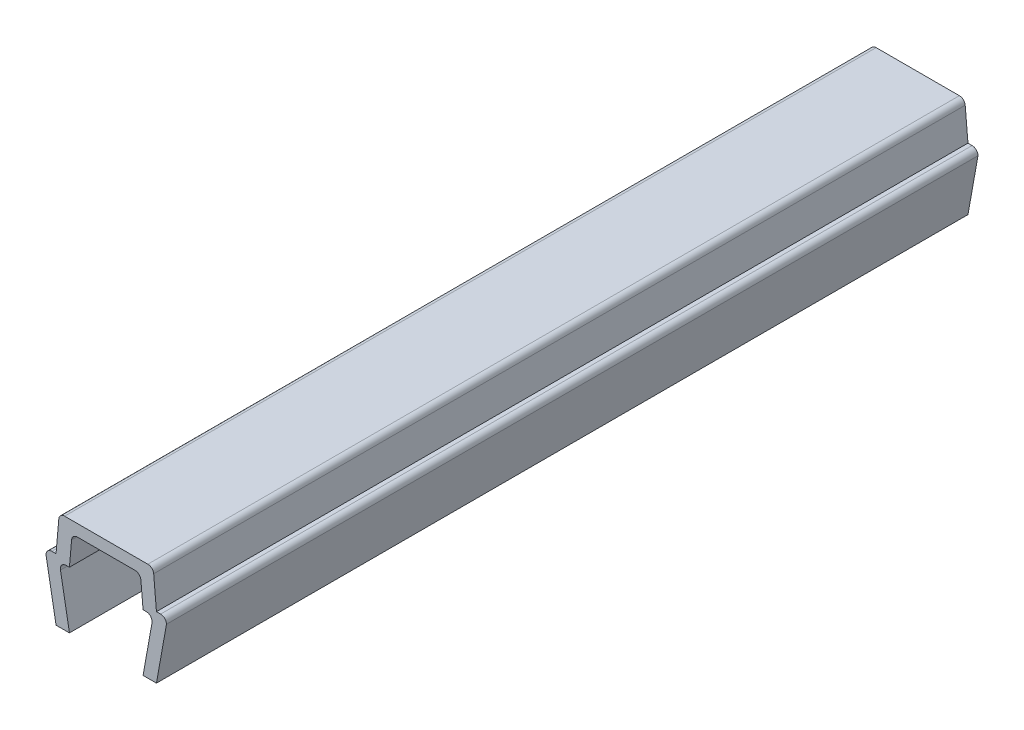
ISO-10303-21;
HEADER;
FILE_DESCRIPTION(('STEP AP214'),'2;1');
FILE_NAME('part.step','',(''),(''),'','','');
FILE_SCHEMA(('AUTOMOTIVE_DESIGN { 1 0 10303 214 1 1 1 1 }'));
ENDSEC;
DATA;
#1=APPLICATION_CONTEXT('core data for automotive mechanical design processes');
#2=APPLICATION_PROTOCOL_DEFINITION('international standard','automotive_design',2000,#1);
#3=PRODUCT_CONTEXT('',#1,'mechanical');
#4=PRODUCT('Part','Part','',(#3));
#5=PRODUCT_RELATED_PRODUCT_CATEGORY('part','',(#4));
#6=PRODUCT_DEFINITION_FORMATION('','',#4);
#7=PRODUCT_DEFINITION_CONTEXT('part definition',#1,'design');
#8=PRODUCT_DEFINITION('design','',#6,#7);
#9=PRODUCT_DEFINITION_SHAPE('','',#8);
#10=(LENGTH_UNIT() NAMED_UNIT(*) SI_UNIT(.MILLI.,.METRE.));
#11=(NAMED_UNIT(*) PLANE_ANGLE_UNIT() SI_UNIT($,.RADIAN.));
#12=(NAMED_UNIT(*) SI_UNIT($,.STERADIAN.) SOLID_ANGLE_UNIT());
#13=UNCERTAINTY_MEASURE_WITH_UNIT(LENGTH_MEASURE(1.E-05),#10,'distance_accuracy_value','');
#14=(GEOMETRIC_REPRESENTATION_CONTEXT(3) GLOBAL_UNCERTAINTY_ASSIGNED_CONTEXT((#13)) GLOBAL_UNIT_ASSIGNED_CONTEXT((#10,
#11,#12)) REPRESENTATION_CONTEXT('',''));
#15=CARTESIAN_POINT('',(0.,0.,0.));
#16=DIRECTION('',(0.,0.,1.));
#17=DIRECTION('',(1.,0.,0.));
#18=AXIS2_PLACEMENT_3D('',#15,#16,#17);
#19=CARTESIAN_POINT('',(-3.25000000000003,3.35000000000003,24.25));
#20=DIRECTION('',(0.,0.,-1.));
#21=DIRECTION('',(-1.,0.,0.));
#22=AXIS2_PLACEMENT_3D('',#19,#20,#21);
#23=CYLINDRICAL_SURFACE('',#22,0.349999999999972);
#24=DIRECTION('',(0.,0.,-1.));
#25=VECTOR('',#24,1.);
#26=CARTESIAN_POINT('',(-3.25,3.7,24.25));
#27=LINE('',#26,#25);
#28=CARTESIAN_POINT('',(-3.25,3.7,24.25));
#29=VERTEX_POINT('',#28);
#30=CARTESIAN_POINT('',(-3.25,3.7,-24.25));
#31=VERTEX_POINT('',#30);
#32=EDGE_CURVE('E211',#29,#31,#27,.T.);
#33=ORIENTED_EDGE('',*,*,#32,.T.);
#34=CARTESIAN_POINT('',(-3.25000000000003,3.35000000000003,-24.25));
#35=DIRECTION('',(0.,0.,1.));
#36=DIRECTION('',(1.,0.,0.));
#37=AXIS2_PLACEMENT_3D('',#34,#35,#36);
#38=CIRCLE('',#37,0.349999999999972);
#39=CARTESIAN_POINT('',(-3.6,3.35,-24.25));
#40=VERTEX_POINT('',#39);
#41=EDGE_CURVE('E205',#31,#40,#38,.T.);
#42=ORIENTED_EDGE('',*,*,#41,.T.);
#43=DIRECTION('',(0.,0.,-1.));
#44=VECTOR('',#43,1.);
#45=CARTESIAN_POINT('',(-3.6,3.35,24.25));
#46=LINE('',#45,#44);
#47=CARTESIAN_POINT('',(-3.6,3.35,24.25));
#48=VERTEX_POINT('',#47);
#49=EDGE_CURVE('E11',#48,#40,#46,.T.);
#50=ORIENTED_EDGE('',*,*,#49,.F.);
#51=CARTESIAN_POINT('',(-3.25000000000003,3.35000000000003,24.25));
#52=DIRECTION('',(0.,0.,1.));
#53=DIRECTION('',(1.,0.,0.));
#54=AXIS2_PLACEMENT_3D('',#51,#52,#53);
#55=CIRCLE('',#54,0.349999999999972);
#56=EDGE_CURVE('E277',#29,#48,#55,.T.);
#57=ORIENTED_EDGE('',*,*,#56,.F.);
#58=EDGE_LOOP('',(#33,#42,#50,#57));
#59=FACE_BOUND('',#58,.T.);
#60=ADVANCED_FACE('F33',(#59),#23,.T.);
#61=CARTESIAN_POINT('',(-3.6,3.35,24.25));
#62=DIRECTION('',(0.984336643247304,0.176299100283099,0.));
#63=DIRECTION('',(-0.176299100283099,0.984336643247304,0.));
#64=AXIS2_PLACEMENT_3D('',#61,#62,#63);
#65=PLANE('',#64);
#66=ORIENTED_EDGE('',*,*,#49,.T.);
#67=DIRECTION('',(0.176299100283099,-0.984336643247304,0.));
#68=VECTOR('',#67,1.);
#69=CARTESIAN_POINT('',(-3.6,3.35,-24.25));
#70=LINE('',#69,#68);
#71=CARTESIAN_POINT('',(-3.,0.,-24.25));
#72=VERTEX_POINT('',#71);
#73=EDGE_CURVE('E195',#40,#72,#70,.T.);
#74=ORIENTED_EDGE('',*,*,#73,.T.);
#75=DIRECTION('',(0.,0.,-1.));
#76=VECTOR('',#75,1.);
#77=CARTESIAN_POINT('',(-3.,0.,24.25));
#78=LINE('',#77,#76);
#79=CARTESIAN_POINT('',(-3.,0.,24.25));
#80=VERTEX_POINT('',#79);
#81=EDGE_CURVE('E40',#80,#72,#78,.T.);
#82=ORIENTED_EDGE('',*,*,#81,.F.);
#83=DIRECTION('',(0.176299100283099,-0.984336643247304,0.));
#84=VECTOR('',#83,1.);
#85=CARTESIAN_POINT('',(-3.6,3.35,24.25));
#86=LINE('',#85,#84);
#87=EDGE_CURVE('E196',#48,#80,#86,.T.);
#88=ORIENTED_EDGE('',*,*,#87,.F.);
#89=EDGE_LOOP('',(#66,#74,#82,#88));
#90=FACE_BOUND('',#89,.T.);
#91=ADVANCED_FACE('F193',(#90),#65,.F.);
#92=CARTESIAN_POINT('',(-3.,0.,24.25));
#93=DIRECTION('',(0.,1.,0.));
#94=DIRECTION('',(0.,0.,1.));
#95=AXIS2_PLACEMENT_3D('',#92,#93,#94);
#96=PLANE('',#95);
#97=ORIENTED_EDGE('',*,*,#81,.T.);
#98=DIRECTION('',(1.,0.,0.));
#99=VECTOR('',#98,1.);
#100=CARTESIAN_POINT('',(-3.,0.,-24.25));
#101=LINE('',#100,#99);
#102=CARTESIAN_POINT('',(-2.2,0.,-24.25));
#103=VERTEX_POINT('',#102);
#104=EDGE_CURVE('E209',#72,#103,#101,.T.);
#105=ORIENTED_EDGE('',*,*,#104,.T.);
#106=DIRECTION('',(0.,0.,-1.));
#107=VECTOR('',#106,1.);
#108=CARTESIAN_POINT('',(-2.2,0.,24.25));
#109=LINE('',#108,#107);
#110=CARTESIAN_POINT('',(-2.2,0.,24.25));
#111=VERTEX_POINT('',#110);
#112=EDGE_CURVE('E363',#111,#103,#109,.T.);
#113=ORIENTED_EDGE('',*,*,#112,.F.);
#114=DIRECTION('',(1.,0.,0.));
#115=VECTOR('',#114,1.);
#116=CARTESIAN_POINT('',(-3.,0.,24.25));
#117=LINE('',#116,#115);
#118=EDGE_CURVE('E280',#80,#111,#117,.T.);
#119=ORIENTED_EDGE('',*,*,#118,.F.);
#120=EDGE_LOOP('',(#97,#105,#113,#119));
#121=FACE_BOUND('',#120,.T.);
#122=ADVANCED_FACE('F366',(#121),#96,.F.);
#123=CARTESIAN_POINT('',(-2.2,0.,24.25));
#124=DIRECTION('',(-0.984336643247306,-0.176299100283088,0.));
#125=DIRECTION('',(0.176299100283088,-0.984336643247306,0.));
#126=AXIS2_PLACEMENT_3D('',#123,#124,#125);
#127=PLANE('',#126);
#128=ORIENTED_EDGE('',*,*,#112,.T.);
#129=DIRECTION('',(-0.176299100283088,0.984336643247306,0.));
#130=VECTOR('',#129,1.);
#131=CARTESIAN_POINT('',(-2.2,0.,-24.25));
#132=LINE('',#131,#130);
#133=CARTESIAN_POINT('',(-2.7352170713255,2.9882953149009,-24.25));
#134=VERTEX_POINT('',#133);
#135=EDGE_CURVE('E215',#103,#134,#132,.T.);
#136=ORIENTED_EDGE('',*,*,#135,.T.);
#137=DIRECTION('',(0.,0.,-1.));
#138=VECTOR('',#137,1.);
#139=CARTESIAN_POINT('',(-2.7352170713255,2.9882953149009,24.25));
#140=LINE('',#139,#138);
#141=CARTESIAN_POINT('',(-2.7352170713255,2.9882953149009,24.25));
#142=VERTEX_POINT('',#141);
#143=EDGE_CURVE('E361',#142,#134,#140,.T.);
#144=ORIENTED_EDGE('',*,*,#143,.F.);
#145=DIRECTION('',(-0.176299100283088,0.984336643247306,0.));
#146=VECTOR('',#145,1.);
#147=CARTESIAN_POINT('',(-2.2,0.,24.25));
#148=LINE('',#147,#146);
#149=EDGE_CURVE('E282',#111,#142,#148,.T.);
#150=ORIENTED_EDGE('',*,*,#149,.F.);
#151=EDGE_LOOP('',(#128,#136,#144,#150));
#152=FACE_BOUND('',#151,.T.);
#153=ADVANCED_FACE('F374',(#152),#127,.F.);
#154=CARTESIAN_POINT('',(-2.390699246189,3.05000000000004,24.25));
#155=DIRECTION('',(0.,0.,-1.));
#156=DIRECTION('',(-1.,0.,0.));
#157=AXIS2_PLACEMENT_3D('',#154,#155,#156);
#158=CYLINDRICAL_SURFACE('',#157,0.349999999999955);
#159=ORIENTED_EDGE('',*,*,#143,.T.);
#160=CARTESIAN_POINT('',(-2.390699246189,3.05000000000004,-24.25));
#161=DIRECTION('',(0.,0.,-1.));
#162=DIRECTION('',(-1.,0.,0.));
#163=AXIS2_PLACEMENT_3D('',#160,#161,#162);
#164=CIRCLE('',#163,0.349999999999955);
#165=CARTESIAN_POINT('',(-2.390699246189,3.4,-24.25));
#166=VERTEX_POINT('',#165);
#167=EDGE_CURVE('E218',#134,#166,#164,.T.);
#168=ORIENTED_EDGE('',*,*,#167,.T.);
#169=DIRECTION('',(0.,0.,-1.));
#170=VECTOR('',#169,1.);
#171=CARTESIAN_POINT('',(-2.390699246189,3.4,24.25));
#172=LINE('',#171,#170);
#173=CARTESIAN_POINT('',(-2.390699246189,3.4,24.25));
#174=VERTEX_POINT('',#173);
#175=EDGE_CURVE('E359',#174,#166,#172,.T.);
#176=ORIENTED_EDGE('',*,*,#175,.F.);
#177=CARTESIAN_POINT('',(-2.390699246189,3.05000000000004,24.25));
#178=DIRECTION('',(0.,0.,-1.));
#179=DIRECTION('',(-1.,0.,0.));
#180=AXIS2_PLACEMENT_3D('',#177,#178,#179);
#181=CIRCLE('',#180,0.349999999999955);
#182=EDGE_CURVE('E284',#142,#174,#181,.T.);
#183=ORIENTED_EDGE('',*,*,#182,.F.);
#184=EDGE_LOOP('',(#159,#168,#176,#183));
#185=FACE_BOUND('',#184,.T.);
#186=ADVANCED_FACE('F377',(#185),#158,.F.);
#187=CARTESIAN_POINT('',(-2.390699246189,3.4,24.25));
#188=DIRECTION('',(0.,1.,0.));
#189=DIRECTION('',(0.,0.,1.));
#190=AXIS2_PLACEMENT_3D('',#187,#188,#189);
#191=PLANE('',#190);
#192=ORIENTED_EDGE('',*,*,#175,.T.);
#193=DIRECTION('',(1.,0.,0.));
#194=VECTOR('',#193,1.);
#195=CARTESIAN_POINT('',(-2.390699246189,3.4,-24.25));
#196=LINE('',#195,#194);
#197=CARTESIAN_POINT('',(-2.2,3.4,-24.25));
#198=VERTEX_POINT('',#197);
#199=EDGE_CURVE('E221',#166,#198,#196,.T.);
#200=ORIENTED_EDGE('',*,*,#199,.T.);
#201=DIRECTION('',(0.,0.,-1.));
#202=VECTOR('',#201,1.);
#203=CARTESIAN_POINT('',(-2.2,3.4,24.25));
#204=LINE('',#203,#202);
#205=CARTESIAN_POINT('',(-2.2,3.4,24.25));
#206=VERTEX_POINT('',#205);
#207=EDGE_CURVE('E357',#206,#198,#204,.T.);
#208=ORIENTED_EDGE('',*,*,#207,.F.);
#209=DIRECTION('',(1.,0.,0.));
#210=VECTOR('',#209,1.);
#211=CARTESIAN_POINT('',(-2.390699246189,3.4,24.25));
#212=LINE('',#211,#210);
#213=EDGE_CURVE('E286',#174,#206,#212,.T.);
#214=ORIENTED_EDGE('',*,*,#213,.F.);
#215=EDGE_LOOP('',(#192,#200,#208,#214));
#216=FACE_BOUND('',#215,.T.);
#217=ADVANCED_FACE('F382',(#216),#191,.F.);
#218=CARTESIAN_POINT('',(-2.2,3.4,24.25));
#219=DIRECTION('',(-0.996194698091743,0.08715574274769,0.));
#220=DIRECTION('',(-0.08715574274769,-0.996194698091743,0.));
#221=AXIS2_PLACEMENT_3D('',#218,#219,#220);
#222=PLANE('',#221);
#223=ORIENTED_EDGE('',*,*,#207,.T.);
#224=DIRECTION('',(0.08715574274769,0.996194698091743,0.));
#225=VECTOR('',#224,1.);
#226=CARTESIAN_POINT('',(-2.2,3.4,-24.25));
#227=LINE('',#226,#225);
#228=CARTESIAN_POINT('',(-2.0704726390793,4.8805045099617,-24.25));
#229=VERTEX_POINT('',#228);
#230=EDGE_CURVE('E224',#198,#229,#227,.T.);
#231=ORIENTED_EDGE('',*,*,#230,.T.);
#232=DIRECTION('',(0.,0.,-1.));
#233=VECTOR('',#232,1.);
#234=CARTESIAN_POINT('',(-2.0704726390793,4.8805045099617,24.25));
#235=LINE('',#234,#233);
#236=CARTESIAN_POINT('',(-2.0704726390793,4.8805045099617,24.25));
#237=VERTEX_POINT('',#236);
#238=EDGE_CURVE('E355',#237,#229,#235,.T.);
#239=ORIENTED_EDGE('',*,*,#238,.F.);
#240=DIRECTION('',(0.08715574274769,0.996194698091743,0.));
#241=VECTOR('',#240,1.);
#242=CARTESIAN_POINT('',(-2.2,3.4,24.25));
#243=LINE('',#242,#241);
#244=EDGE_CURVE('E288',#206,#237,#243,.T.);
#245=ORIENTED_EDGE('',*,*,#244,.F.);
#246=EDGE_LOOP('',(#223,#231,#239,#245));
#247=FACE_BOUND('',#246,.T.);
#248=ADVANCED_FACE('F388',(#247),#222,.F.);
#249=CARTESIAN_POINT('',(-1.72180449474716,4.84999999999996,24.25));
#250=DIRECTION('',(0.,0.,-1.));
#251=DIRECTION('',(-1.,0.,0.));
#252=AXIS2_PLACEMENT_3D('',#249,#250,#251);
#253=CYLINDRICAL_SURFACE('',#252,0.350000000000036);
#254=ORIENTED_EDGE('',*,*,#238,.T.);
#255=CARTESIAN_POINT('',(-1.72180449474716,4.84999999999996,-24.25));
#256=DIRECTION('',(0.,0.,-1.));
#257=DIRECTION('',(-1.,0.,0.));
#258=AXIS2_PLACEMENT_3D('',#255,#256,#257);
#259=CIRCLE('',#258,0.350000000000036);
#260=CARTESIAN_POINT('',(-1.7218044947472,5.2,-24.25));
#261=VERTEX_POINT('',#260);
#262=EDGE_CURVE('E227',#229,#261,#259,.T.);
#263=ORIENTED_EDGE('',*,*,#262,.T.);
#264=DIRECTION('',(0.,0.,-1.));
#265=VECTOR('',#264,1.);
#266=CARTESIAN_POINT('',(-1.7218044947472,5.2,24.25));
#267=LINE('',#266,#265);
#268=CARTESIAN_POINT('',(-1.7218044947472,5.2,24.25));
#269=VERTEX_POINT('',#268);
#270=EDGE_CURVE('E353',#269,#261,#267,.T.);
#271=ORIENTED_EDGE('',*,*,#270,.F.);
#272=CARTESIAN_POINT('',(-1.72180449474716,4.84999999999996,24.25));
#273=DIRECTION('',(0.,0.,-1.));
#274=DIRECTION('',(-1.,0.,0.));
#275=AXIS2_PLACEMENT_3D('',#272,#273,#274);
#276=CIRCLE('',#275,0.350000000000036);
#277=EDGE_CURVE('E290',#237,#269,#276,.T.);
#278=ORIENTED_EDGE('',*,*,#277,.F.);
#279=EDGE_LOOP('',(#254,#263,#271,#278));
#280=FACE_BOUND('',#279,.T.);
#281=ADVANCED_FACE('F392',(#280),#253,.F.);
#282=CARTESIAN_POINT('',(-1.7218044947472,5.2,24.25));
#283=DIRECTION('',(0.,1.,0.));
#284=DIRECTION('',(0.,0.,1.));
#285=AXIS2_PLACEMENT_3D('',#282,#283,#284);
#286=PLANE('',#285);
#287=ORIENTED_EDGE('',*,*,#270,.T.);
#288=DIRECTION('',(1.,0.,0.));
#289=VECTOR('',#288,1.);
#290=CARTESIAN_POINT('',(-1.7218044947472,5.2,-24.25));
#291=LINE('',#290,#289);
#292=CARTESIAN_POINT('',(1.7218044947472,5.2,-24.25));
#293=VERTEX_POINT('',#292);
#294=EDGE_CURVE('E230',#261,#293,#291,.T.);
#295=ORIENTED_EDGE('',*,*,#294,.T.);
#296=DIRECTION('',(0.,0.,-1.));
#297=VECTOR('',#296,1.);
#298=CARTESIAN_POINT('',(1.7218044947472,5.2,24.25));
#299=LINE('',#298,#297);
#300=CARTESIAN_POINT('',(1.7218044947472,5.2,24.25));
#301=VERTEX_POINT('',#300);
#302=EDGE_CURVE('E351',#301,#293,#299,.T.);
#303=ORIENTED_EDGE('',*,*,#302,.F.);
#304=DIRECTION('',(1.,0.,0.));
#305=VECTOR('',#304,1.);
#306=CARTESIAN_POINT('',(-1.7218044947472,5.2,24.25));
#307=LINE('',#306,#305);
#308=EDGE_CURVE('E292',#269,#301,#307,.T.);
#309=ORIENTED_EDGE('',*,*,#308,.F.);
#310=EDGE_LOOP('',(#287,#295,#303,#309));
#311=FACE_BOUND('',#310,.T.);
#312=ADVANCED_FACE('F397',(#311),#286,.F.);
#313=CARTESIAN_POINT('',(1.72180449474716,4.84999999999996,24.25));
#314=DIRECTION('',(0.,0.,-1.));
#315=DIRECTION('',(-1.,0.,0.));
#316=AXIS2_PLACEMENT_3D('',#313,#314,#315);
#317=CYLINDRICAL_SURFACE('',#316,0.350000000000036);
#318=ORIENTED_EDGE('',*,*,#302,.T.);
#319=CARTESIAN_POINT('',(1.72180449474716,4.84999999999996,-24.25));
#320=DIRECTION('',(0.,0.,-1.));
#321=DIRECTION('',(-1.,0.,0.));
#322=AXIS2_PLACEMENT_3D('',#319,#320,#321);
#323=CIRCLE('',#322,0.350000000000036);
#324=CARTESIAN_POINT('',(2.0704726390793,4.8805045099617,-24.25));
#325=VERTEX_POINT('',#324);
#326=EDGE_CURVE('E233',#293,#325,#323,.T.);
#327=ORIENTED_EDGE('',*,*,#326,.T.);
#328=DIRECTION('',(0.,0.,-1.));
#329=VECTOR('',#328,1.);
#330=CARTESIAN_POINT('',(2.0704726390793,4.8805045099617,24.25));
#331=LINE('',#330,#329);
#332=CARTESIAN_POINT('',(2.0704726390793,4.8805045099617,24.25));
#333=VERTEX_POINT('',#332);
#334=EDGE_CURVE('E349',#333,#325,#331,.T.);
#335=ORIENTED_EDGE('',*,*,#334,.F.);
#336=CARTESIAN_POINT('',(1.72180449474716,4.84999999999996,24.25));
#337=DIRECTION('',(0.,0.,-1.));
#338=DIRECTION('',(-1.,0.,0.));
#339=AXIS2_PLACEMENT_3D('',#336,#337,#338);
#340=CIRCLE('',#339,0.350000000000036);
#341=EDGE_CURVE('E294',#301,#333,#340,.T.);
#342=ORIENTED_EDGE('',*,*,#341,.F.);
#343=EDGE_LOOP('',(#318,#327,#335,#342));
#344=FACE_BOUND('',#343,.T.);
#345=ADVANCED_FACE('F403',(#344),#317,.F.);
#346=CARTESIAN_POINT('',(2.0704726390793,4.8805045099617,24.25));
#347=DIRECTION('',(0.996194698091743,0.08715574274769,0.));
#348=DIRECTION('',(-0.08715574274769,0.996194698091743,0.));
#349=AXIS2_PLACEMENT_3D('',#346,#347,#348);
#350=PLANE('',#349);
#351=ORIENTED_EDGE('',*,*,#334,.T.);
#352=DIRECTION('',(0.08715574274769,-0.996194698091743,0.));
#353=VECTOR('',#352,1.);
#354=CARTESIAN_POINT('',(2.0704726390793,4.8805045099617,-24.25));
#355=LINE('',#354,#353);
#356=CARTESIAN_POINT('',(2.2,3.4,-24.25));
#357=VERTEX_POINT('',#356);
#358=EDGE_CURVE('E236',#325,#357,#355,.T.);
#359=ORIENTED_EDGE('',*,*,#358,.T.);
#360=DIRECTION('',(0.,0.,-1.));
#361=VECTOR('',#360,1.);
#362=CARTESIAN_POINT('',(2.2,3.4,24.25));
#363=LINE('',#362,#361);
#364=CARTESIAN_POINT('',(2.2,3.4,24.25));
#365=VERTEX_POINT('',#364);
#366=EDGE_CURVE('E347',#365,#357,#363,.T.);
#367=ORIENTED_EDGE('',*,*,#366,.F.);
#368=DIRECTION('',(0.08715574274769,-0.996194698091743,0.));
#369=VECTOR('',#368,1.);
#370=CARTESIAN_POINT('',(2.0704726390793,4.8805045099617,24.25));
#371=LINE('',#370,#369);
#372=EDGE_CURVE('E296',#333,#365,#371,.T.);
#373=ORIENTED_EDGE('',*,*,#372,.F.);
#374=EDGE_LOOP('',(#351,#359,#367,#373));
#375=FACE_BOUND('',#374,.T.);
#376=ADVANCED_FACE('F407',(#375),#350,.F.);
#377=CARTESIAN_POINT('',(2.2,3.4,24.25));
#378=DIRECTION('',(0.,1.,0.));
#379=DIRECTION('',(0.,0.,1.));
#380=AXIS2_PLACEMENT_3D('',#377,#378,#379);
#381=PLANE('',#380);
#382=ORIENTED_EDGE('',*,*,#366,.T.);
#383=DIRECTION('',(1.,0.,0.));
#384=VECTOR('',#383,1.);
#385=CARTESIAN_POINT('',(2.2,3.4,-24.25));
#386=LINE('',#385,#384);
#387=CARTESIAN_POINT('',(2.390699246189,3.4,-24.25));
#388=VERTEX_POINT('',#387);
#389=EDGE_CURVE('E239',#357,#388,#386,.T.);
#390=ORIENTED_EDGE('',*,*,#389,.T.);
#391=DIRECTION('',(0.,0.,-1.));
#392=VECTOR('',#391,1.);
#393=CARTESIAN_POINT('',(2.390699246189,3.4,24.25));
#394=LINE('',#393,#392);
#395=CARTESIAN_POINT('',(2.390699246189,3.4,24.25));
#396=VERTEX_POINT('',#395);
#397=EDGE_CURVE('E345',#396,#388,#394,.T.);
#398=ORIENTED_EDGE('',*,*,#397,.F.);
#399=DIRECTION('',(1.,0.,0.));
#400=VECTOR('',#399,1.);
#401=CARTESIAN_POINT('',(2.2,3.4,24.25));
#402=LINE('',#401,#400);
#403=EDGE_CURVE('E298',#365,#396,#402,.T.);
#404=ORIENTED_EDGE('',*,*,#403,.F.);
#405=EDGE_LOOP('',(#382,#390,#398,#404));
#406=FACE_BOUND('',#405,.T.);
#407=ADVANCED_FACE('F412',(#406),#381,.F.);
#408=CARTESIAN_POINT('',(2.390699246189,3.05000000000004,24.25));
#409=DIRECTION('',(0.,0.,-1.));
#410=DIRECTION('',(-1.,0.,0.));
#411=AXIS2_PLACEMENT_3D('',#408,#409,#410);
#412=CYLINDRICAL_SURFACE('',#411,0.349999999999955);
#413=ORIENTED_EDGE('',*,*,#397,.T.);
#414=CARTESIAN_POINT('',(2.390699246189,3.05000000000004,-24.25));
#415=DIRECTION('',(0.,0.,-1.));
#416=DIRECTION('',(-1.,0.,0.));
#417=AXIS2_PLACEMENT_3D('',#414,#415,#416);
#418=CIRCLE('',#417,0.349999999999955);
#419=CARTESIAN_POINT('',(2.7352170713255,2.9882953149009,-24.25));
#420=VERTEX_POINT('',#419);
#421=EDGE_CURVE('E242',#388,#420,#418,.T.);
#422=ORIENTED_EDGE('',*,*,#421,.T.);
#423=DIRECTION('',(0.,0.,-1.));
#424=VECTOR('',#423,1.);
#425=CARTESIAN_POINT('',(2.7352170713255,2.9882953149009,24.25));
#426=LINE('',#425,#424);
#427=CARTESIAN_POINT('',(2.7352170713255,2.9882953149009,24.25));
#428=VERTEX_POINT('',#427);
#429=EDGE_CURVE('E343',#428,#420,#426,.T.);
#430=ORIENTED_EDGE('',*,*,#429,.F.);
#431=CARTESIAN_POINT('',(2.390699246189,3.05000000000004,24.25));
#432=DIRECTION('',(0.,0.,-1.));
#433=DIRECTION('',(-1.,0.,0.));
#434=AXIS2_PLACEMENT_3D('',#431,#432,#433);
#435=CIRCLE('',#434,0.349999999999955);
#436=EDGE_CURVE('E300',#396,#428,#435,.T.);
#437=ORIENTED_EDGE('',*,*,#436,.F.);
#438=EDGE_LOOP('',(#413,#422,#430,#437));
#439=FACE_BOUND('',#438,.T.);
#440=ADVANCED_FACE('F418',(#439),#412,.F.);
#441=CARTESIAN_POINT('',(2.7352170713255,2.9882953149009,24.25));
#442=DIRECTION('',(0.984336643247306,-0.176299100283088,0.));
#443=DIRECTION('',(0.176299100283088,0.984336643247306,0.));
#444=AXIS2_PLACEMENT_3D('',#441,#442,#443);
#445=PLANE('',#444);
#446=ORIENTED_EDGE('',*,*,#429,.T.);
#447=DIRECTION('',(-0.176299100283088,-0.984336643247306,0.));
#448=VECTOR('',#447,1.);
#449=CARTESIAN_POINT('',(2.7352170713255,2.9882953149009,-24.25));
#450=LINE('',#449,#448);
#451=CARTESIAN_POINT('',(2.2,0.,-24.25));
#452=VERTEX_POINT('',#451);
#453=EDGE_CURVE('E245',#420,#452,#450,.T.);
#454=ORIENTED_EDGE('',*,*,#453,.T.);
#455=DIRECTION('',(0.,0.,-1.));
#456=VECTOR('',#455,1.);
#457=CARTESIAN_POINT('',(2.2,0.,24.25));
#458=LINE('',#457,#456);
#459=CARTESIAN_POINT('',(2.2,0.,24.25));
#460=VERTEX_POINT('',#459);
#461=EDGE_CURVE('E341',#460,#452,#458,.T.);
#462=ORIENTED_EDGE('',*,*,#461,.F.);
#463=DIRECTION('',(-0.176299100283088,-0.984336643247306,0.));
#464=VECTOR('',#463,1.);
#465=CARTESIAN_POINT('',(2.7352170713255,2.9882953149009,24.25));
#466=LINE('',#465,#464);
#467=EDGE_CURVE('E302',#428,#460,#466,.T.);
#468=ORIENTED_EDGE('',*,*,#467,.F.);
#469=EDGE_LOOP('',(#446,#454,#462,#468));
#470=FACE_BOUND('',#469,.T.);
#471=ADVANCED_FACE('F422',(#470),#445,.F.);
#472=CARTESIAN_POINT('',(2.2,0.,24.25));
#473=DIRECTION('',(0.,1.,0.));
#474=DIRECTION('',(0.,0.,1.));
#475=AXIS2_PLACEMENT_3D('',#472,#473,#474);
#476=PLANE('',#475);
#477=ORIENTED_EDGE('',*,*,#461,.T.);
#478=DIRECTION('',(1.,0.,0.));
#479=VECTOR('',#478,1.);
#480=CARTESIAN_POINT('',(2.2,0.,-24.25));
#481=LINE('',#480,#479);
#482=CARTESIAN_POINT('',(3.,0.,-24.25));
#483=VERTEX_POINT('',#482);
#484=EDGE_CURVE('E248',#452,#483,#481,.T.);
#485=ORIENTED_EDGE('',*,*,#484,.T.);
#486=DIRECTION('',(0.,0.,-1.));
#487=VECTOR('',#486,1.);
#488=CARTESIAN_POINT('',(3.,0.,24.25));
#489=LINE('',#488,#487);
#490=CARTESIAN_POINT('',(3.,0.,24.25));
#491=VERTEX_POINT('',#490);
#492=EDGE_CURVE('E339',#491,#483,#489,.T.);
#493=ORIENTED_EDGE('',*,*,#492,.F.);
#494=DIRECTION('',(1.,0.,0.));
#495=VECTOR('',#494,1.);
#496=CARTESIAN_POINT('',(2.2,0.,24.25));
#497=LINE('',#496,#495);
#498=EDGE_CURVE('E304',#460,#491,#497,.T.);
#499=ORIENTED_EDGE('',*,*,#498,.F.);
#500=EDGE_LOOP('',(#477,#485,#493,#499));
#501=FACE_BOUND('',#500,.T.);
#502=ADVANCED_FACE('F427',(#501),#476,.F.);
#503=CARTESIAN_POINT('',(3.,0.,24.25));
#504=DIRECTION('',(-0.984336643247304,0.176299100283099,0.));
#505=DIRECTION('',(-0.176299100283099,-0.984336643247304,0.));
#506=AXIS2_PLACEMENT_3D('',#503,#504,#505);
#507=PLANE('',#506);
#508=ORIENTED_EDGE('',*,*,#492,.T.);
#509=DIRECTION('',(0.176299100283099,0.984336643247304,0.));
#510=VECTOR('',#509,1.);
#511=CARTESIAN_POINT('',(3.,0.,-24.25));
#512=LINE('',#511,#510);
#513=CARTESIAN_POINT('',(3.6,3.35,-24.25));
#514=VERTEX_POINT('',#513);
#515=EDGE_CURVE('E251',#483,#514,#512,.T.);
#516=ORIENTED_EDGE('',*,*,#515,.T.);
#517=DIRECTION('',(0.,0.,-1.));
#518=VECTOR('',#517,1.);
#519=CARTESIAN_POINT('',(3.6,3.35,24.25));
#520=LINE('',#519,#518);
#521=CARTESIAN_POINT('',(3.6,3.35,24.25));
#522=VERTEX_POINT('',#521);
#523=EDGE_CURVE('E337',#522,#514,#520,.T.);
#524=ORIENTED_EDGE('',*,*,#523,.F.);
#525=DIRECTION('',(0.176299100283099,0.984336643247304,0.));
#526=VECTOR('',#525,1.);
#527=CARTESIAN_POINT('',(3.,0.,24.25));
#528=LINE('',#527,#526);
#529=EDGE_CURVE('E306',#491,#522,#528,.T.);
#530=ORIENTED_EDGE('',*,*,#529,.F.);
#531=EDGE_LOOP('',(#508,#516,#524,#530));
#532=FACE_BOUND('',#531,.T.);
#533=ADVANCED_FACE('F433',(#532),#507,.F.);
#534=CARTESIAN_POINT('',(3.25000000000003,3.35000000000003,24.25));
#535=DIRECTION('',(0.,0.,-1.));
#536=DIRECTION('',(-1.,0.,0.));
#537=AXIS2_PLACEMENT_3D('',#534,#535,#536);
#538=CYLINDRICAL_SURFACE('',#537,0.349999999999972);
#539=ORIENTED_EDGE('',*,*,#523,.T.);
#540=CARTESIAN_POINT('',(3.25000000000003,3.35000000000003,-24.25));
#541=DIRECTION('',(0.,0.,1.));
#542=DIRECTION('',(1.,0.,0.));
#543=AXIS2_PLACEMENT_3D('',#540,#541,#542);
#544=CIRCLE('',#543,0.349999999999972);
#545=CARTESIAN_POINT('',(3.25,3.7,-24.25));
#546=VERTEX_POINT('',#545);
#547=EDGE_CURVE('E254',#514,#546,#544,.T.);
#548=ORIENTED_EDGE('',*,*,#547,.T.);
#549=DIRECTION('',(0.,0.,-1.));
#550=VECTOR('',#549,1.);
#551=CARTESIAN_POINT('',(3.25,3.7,24.25));
#552=LINE('',#551,#550);
#553=CARTESIAN_POINT('',(3.25,3.7,24.25));
#554=VERTEX_POINT('',#553);
#555=EDGE_CURVE('E335',#554,#546,#552,.T.);
#556=ORIENTED_EDGE('',*,*,#555,.F.);
#557=CARTESIAN_POINT('',(3.25000000000003,3.35000000000003,24.25));
#558=DIRECTION('',(0.,0.,1.));
#559=DIRECTION('',(1.,0.,0.));
#560=AXIS2_PLACEMENT_3D('',#557,#558,#559);
#561=CIRCLE('',#560,0.349999999999972);
#562=EDGE_CURVE('E308',#522,#554,#561,.T.);
#563=ORIENTED_EDGE('',*,*,#562,.F.);
#564=EDGE_LOOP('',(#539,#548,#556,#563));
#565=FACE_BOUND('',#564,.T.);
#566=ADVANCED_FACE('F437',(#565),#538,.T.);
#567=CARTESIAN_POINT('',(3.25,3.7,24.25));
#568=DIRECTION('',(0.,-1.,0.));
#569=DIRECTION('',(0.,0.,-1.));
#570=AXIS2_PLACEMENT_3D('',#567,#568,#569);
#571=PLANE('',#570);
#572=ORIENTED_EDGE('',*,*,#555,.T.);
#573=DIRECTION('',(-1.,0.,0.));
#574=VECTOR('',#573,1.);
#575=CARTESIAN_POINT('',(3.25,3.7,-24.25));
#576=LINE('',#575,#574);
#577=CARTESIAN_POINT('',(3.,3.7,-24.25));
#578=VERTEX_POINT('',#577);
#579=EDGE_CURVE('E257',#546,#578,#576,.T.);
#580=ORIENTED_EDGE('',*,*,#579,.T.);
#581=DIRECTION('',(0.,0.,-1.));
#582=VECTOR('',#581,1.);
#583=CARTESIAN_POINT('',(3.,3.7,24.25));
#584=LINE('',#583,#582);
#585=CARTESIAN_POINT('',(3.,3.7,24.25));
#586=VERTEX_POINT('',#585);
#587=EDGE_CURVE('E333',#586,#578,#584,.T.);
#588=ORIENTED_EDGE('',*,*,#587,.F.);
#589=DIRECTION('',(-1.,0.,0.));
#590=VECTOR('',#589,1.);
#591=CARTESIAN_POINT('',(3.25,3.7,24.25));
#592=LINE('',#591,#590);
#593=EDGE_CURVE('E310',#554,#586,#592,.T.);
#594=ORIENTED_EDGE('',*,*,#593,.F.);
#595=EDGE_LOOP('',(#572,#580,#588,#594));
#596=FACE_BOUND('',#595,.T.);
#597=ADVANCED_FACE('F442',(#596),#571,.F.);
#598=CARTESIAN_POINT('',(3.,3.7,24.25));
#599=DIRECTION('',(-0.996194698091746,-0.0871557427476467,0.));
#600=DIRECTION('',(0.0871557427476468,-0.996194698091747,0.));
#601=AXIS2_PLACEMENT_3D('',#598,#599,#600);
#602=PLANE('',#601);
#603=ORIENTED_EDGE('',*,*,#587,.T.);
#604=DIRECTION('',(-0.0871557427476467,0.996194698091747,0.));
#605=VECTOR('',#604,1.);
#606=CARTESIAN_POINT('',(3.,3.7,-24.25));
#607=LINE('',#606,#605);
#608=CARTESIAN_POINT('',(2.835477173669,5.5805045099617,-24.25));
#609=VERTEX_POINT('',#608);
#610=EDGE_CURVE('E260',#578,#609,#607,.T.);
#611=ORIENTED_EDGE('',*,*,#610,.T.);
#612=DIRECTION('',(0.,0.,-1.));
#613=VECTOR('',#612,1.);
#614=CARTESIAN_POINT('',(2.835477173669,5.5805045099617,24.25));
#615=LINE('',#614,#613);
#616=CARTESIAN_POINT('',(2.835477173669,5.5805045099617,24.25));
#617=VERTEX_POINT('',#616);
#618=EDGE_CURVE('E331',#617,#609,#615,.T.);
#619=ORIENTED_EDGE('',*,*,#618,.F.);
#620=DIRECTION('',(-0.0871557427476467,0.996194698091747,0.));
#621=VECTOR('',#620,1.);
#622=CARTESIAN_POINT('',(3.,3.7,24.25));
#623=LINE('',#622,#621);
#624=EDGE_CURVE('E312',#586,#617,#623,.T.);
#625=ORIENTED_EDGE('',*,*,#624,.F.);
#626=EDGE_LOOP('',(#603,#611,#619,#625));
#627=FACE_BOUND('',#626,.T.);
#628=ADVANCED_FACE('F448',(#627),#602,.F.);
#629=CARTESIAN_POINT('',(2.48680902933686,5.54999999999996,24.25));
#630=DIRECTION('',(0.,0.,-1.));
#631=DIRECTION('',(-1.,0.,0.));
#632=AXIS2_PLACEMENT_3D('',#629,#630,#631);
#633=CYLINDRICAL_SURFACE('',#632,0.350000000000036);
#634=ORIENTED_EDGE('',*,*,#618,.T.);
#635=CARTESIAN_POINT('',(2.48680902933686,5.54999999999996,-24.25));
#636=DIRECTION('',(0.,0.,1.));
#637=DIRECTION('',(1.,0.,0.));
#638=AXIS2_PLACEMENT_3D('',#635,#636,#637);
#639=CIRCLE('',#638,0.350000000000036);
#640=CARTESIAN_POINT('',(2.4868090293369,5.9,-24.25));
#641=VERTEX_POINT('',#640);
#642=EDGE_CURVE('E263',#609,#641,#639,.T.);
#643=ORIENTED_EDGE('',*,*,#642,.T.);
#644=DIRECTION('',(0.,0.,-1.));
#645=VECTOR('',#644,1.);
#646=CARTESIAN_POINT('',(2.4868090293369,5.9,24.25));
#647=LINE('',#646,#645);
#648=CARTESIAN_POINT('',(2.4868090293369,5.9,24.25));
#649=VERTEX_POINT('',#648);
#650=EDGE_CURVE('E329',#649,#641,#647,.T.);
#651=ORIENTED_EDGE('',*,*,#650,.F.);
#652=CARTESIAN_POINT('',(2.48680902933686,5.54999999999996,24.25));
#653=DIRECTION('',(0.,0.,1.));
#654=DIRECTION('',(1.,0.,0.));
#655=AXIS2_PLACEMENT_3D('',#652,#653,#654);
#656=CIRCLE('',#655,0.350000000000036);
#657=EDGE_CURVE('E314',#617,#649,#656,.T.);
#658=ORIENTED_EDGE('',*,*,#657,.F.);
#659=EDGE_LOOP('',(#634,#643,#651,#658));
#660=FACE_BOUND('',#659,.T.);
#661=ADVANCED_FACE('F452',(#660),#633,.T.);
#662=CARTESIAN_POINT('',(2.4868090293369,5.9,24.25));
#663=DIRECTION('',(0.,-1.,0.));
#664=DIRECTION('',(0.,0.,-1.));
#665=AXIS2_PLACEMENT_3D('',#662,#663,#664);
#666=PLANE('',#665);
#667=ORIENTED_EDGE('',*,*,#650,.T.);
#668=DIRECTION('',(-1.,0.,0.));
#669=VECTOR('',#668,1.);
#670=CARTESIAN_POINT('',(2.4868090293369,5.9,-24.25));
#671=LINE('',#670,#669);
#672=CARTESIAN_POINT('',(-2.4868090293369,5.9,-24.25));
#673=VERTEX_POINT('',#672);
#674=EDGE_CURVE('E266',#641,#673,#671,.T.);
#675=ORIENTED_EDGE('',*,*,#674,.T.);
#676=DIRECTION('',(0.,0.,-1.));
#677=VECTOR('',#676,1.);
#678=CARTESIAN_POINT('',(-2.4868090293369,5.9,24.25));
#679=LINE('',#678,#677);
#680=CARTESIAN_POINT('',(-2.4868090293369,5.9,24.25));
#681=VERTEX_POINT('',#680);
#682=EDGE_CURVE('E327',#681,#673,#679,.T.);
#683=ORIENTED_EDGE('',*,*,#682,.F.);
#684=DIRECTION('',(-1.,0.,0.));
#685=VECTOR('',#684,1.);
#686=CARTESIAN_POINT('',(2.4868090293369,5.9,24.25));
#687=LINE('',#686,#685);
#688=EDGE_CURVE('E316',#649,#681,#687,.T.);
#689=ORIENTED_EDGE('',*,*,#688,.F.);
#690=EDGE_LOOP('',(#667,#675,#683,#689));
#691=FACE_BOUND('',#690,.T.);
#692=ADVANCED_FACE('F457',(#691),#666,.F.);
#693=CARTESIAN_POINT('',(-2.48680902933686,5.54999999999996,24.25));
#694=DIRECTION('',(0.,0.,-1.));
#695=DIRECTION('',(-1.,0.,0.));
#696=AXIS2_PLACEMENT_3D('',#693,#694,#695);
#697=CYLINDRICAL_SURFACE('',#696,0.350000000000036);
#698=ORIENTED_EDGE('',*,*,#682,.T.);
#699=CARTESIAN_POINT('',(-2.48680902933686,5.54999999999996,-24.25));
#700=DIRECTION('',(0.,0.,1.));
#701=DIRECTION('',(1.,0.,0.));
#702=AXIS2_PLACEMENT_3D('',#699,#700,#701);
#703=CIRCLE('',#702,0.350000000000036);
#704=CARTESIAN_POINT('',(-2.835477173669,5.5805045099617,-24.25));
#705=VERTEX_POINT('',#704);
#706=EDGE_CURVE('E269',#673,#705,#703,.T.);
#707=ORIENTED_EDGE('',*,*,#706,.T.);
#708=DIRECTION('',(0.,0.,-1.));
#709=VECTOR('',#708,1.);
#710=CARTESIAN_POINT('',(-2.835477173669,5.5805045099617,24.25));
#711=LINE('',#710,#709);
#712=CARTESIAN_POINT('',(-2.835477173669,5.5805045099617,24.25));
#713=VERTEX_POINT('',#712);
#714=EDGE_CURVE('E325',#713,#705,#711,.T.);
#715=ORIENTED_EDGE('',*,*,#714,.F.);
#716=CARTESIAN_POINT('',(-2.48680902933686,5.54999999999996,24.25));
#717=DIRECTION('',(0.,0.,1.));
#718=DIRECTION('',(1.,0.,0.));
#719=AXIS2_PLACEMENT_3D('',#716,#717,#718);
#720=CIRCLE('',#719,0.350000000000036);
#721=EDGE_CURVE('E318',#681,#713,#720,.T.);
#722=ORIENTED_EDGE('',*,*,#721,.F.);
#723=EDGE_LOOP('',(#698,#707,#715,#722));
#724=FACE_BOUND('',#723,.T.);
#725=ADVANCED_FACE('F461',(#724),#697,.T.);
#726=CARTESIAN_POINT('',(-2.835477173669,5.5805045099617,24.25));
#727=DIRECTION('',(0.996194698091746,-0.0871557427476467,0.));
#728=DIRECTION('',(0.0871557427476468,0.996194698091747,0.));
#729=AXIS2_PLACEMENT_3D('',#726,#727,#728);
#730=PLANE('',#729);
#731=ORIENTED_EDGE('',*,*,#714,.T.);
#732=DIRECTION('',(-0.0871557427476467,-0.996194698091747,0.));
#733=VECTOR('',#732,1.);
#734=CARTESIAN_POINT('',(-2.835477173669,5.5805045099617,-24.25));
#735=LINE('',#734,#733);
#736=CARTESIAN_POINT('',(-3.,3.7,-24.25));
#737=VERTEX_POINT('',#736);
#738=EDGE_CURVE('E272',#705,#737,#735,.T.);
#739=ORIENTED_EDGE('',*,*,#738,.T.);
#740=DIRECTION('',(0.,0.,-1.));
#741=VECTOR('',#740,1.);
#742=CARTESIAN_POINT('',(-3.,3.7,24.25));
#743=LINE('',#742,#741);
#744=CARTESIAN_POINT('',(-3.,3.7,24.25));
#745=VERTEX_POINT('',#744);
#746=EDGE_CURVE('E323',#745,#737,#743,.T.);
#747=ORIENTED_EDGE('',*,*,#746,.F.);
#748=DIRECTION('',(-0.0871557427476467,-0.996194698091747,0.));
#749=VECTOR('',#748,1.);
#750=CARTESIAN_POINT('',(-2.835477173669,5.5805045099617,24.25));
#751=LINE('',#750,#749);
#752=EDGE_CURVE('E52',#713,#745,#751,.T.);
#753=ORIENTED_EDGE('',*,*,#752,.F.);
#754=EDGE_LOOP('',(#731,#739,#747,#753));
#755=FACE_BOUND('',#754,.T.);
#756=ADVANCED_FACE('F465',(#755),#730,.F.);
#757=CARTESIAN_POINT('',(-3.,3.7,24.25));
#758=DIRECTION('',(0.,-1.,0.));
#759=DIRECTION('',(0.,0.,-1.));
#760=AXIS2_PLACEMENT_3D('',#757,#758,#759);
#761=PLANE('',#760);
#762=ORIENTED_EDGE('',*,*,#746,.T.);
#763=DIRECTION('',(-1.,0.,0.));
#764=VECTOR('',#763,1.);
#765=CARTESIAN_POINT('',(-3.,3.7,-24.25));
#766=LINE('',#765,#764);
#767=EDGE_CURVE('E275',#737,#31,#766,.T.);
#768=ORIENTED_EDGE('',*,*,#767,.T.);
#769=ORIENTED_EDGE('',*,*,#32,.F.);
#770=DIRECTION('',(-1.,0.,0.));
#771=VECTOR('',#770,1.);
#772=CARTESIAN_POINT('',(-3.,3.7,24.25));
#773=LINE('',#772,#771);
#774=EDGE_CURVE('E47',#745,#29,#773,.T.);
#775=ORIENTED_EDGE('',*,*,#774,.F.);
#776=EDGE_LOOP('',(#762,#768,#769,#775));
#777=FACE_BOUND('',#776,.T.);
#778=ADVANCED_FACE('F467',(#777),#761,.F.);
#779=CARTESIAN_POINT('',(-3.25000000000003,3.35000000000003,24.25));
#780=DIRECTION('',(0.,0.,1.));
#781=DIRECTION('',(1.,0.,0.));
#782=AXIS2_PLACEMENT_3D('',#779,#780,#781);
#783=PLANE('',#782);
#784=ORIENTED_EDGE('',*,*,#56,.T.);
#785=ORIENTED_EDGE('',*,*,#87,.T.);
#786=ORIENTED_EDGE('',*,*,#118,.T.);
#787=ORIENTED_EDGE('',*,*,#149,.T.);
#788=ORIENTED_EDGE('',*,*,#182,.T.);
#789=ORIENTED_EDGE('',*,*,#213,.T.);
#790=ORIENTED_EDGE('',*,*,#244,.T.);
#791=ORIENTED_EDGE('',*,*,#277,.T.);
#792=ORIENTED_EDGE('',*,*,#308,.T.);
#793=ORIENTED_EDGE('',*,*,#341,.T.);
#794=ORIENTED_EDGE('',*,*,#372,.T.);
#795=ORIENTED_EDGE('',*,*,#403,.T.);
#796=ORIENTED_EDGE('',*,*,#436,.T.);
#797=ORIENTED_EDGE('',*,*,#467,.T.);
#798=ORIENTED_EDGE('',*,*,#498,.T.);
#799=ORIENTED_EDGE('',*,*,#529,.T.);
#800=ORIENTED_EDGE('',*,*,#562,.T.);
#801=ORIENTED_EDGE('',*,*,#593,.T.);
#802=ORIENTED_EDGE('',*,*,#624,.T.);
#803=ORIENTED_EDGE('',*,*,#657,.T.);
#804=ORIENTED_EDGE('',*,*,#688,.T.);
#805=ORIENTED_EDGE('',*,*,#721,.T.);
#806=ORIENTED_EDGE('',*,*,#752,.T.);
#807=ORIENTED_EDGE('',*,*,#774,.T.);
#808=EDGE_LOOP('',(#784,#785,#786,#787,#788,#789,#790,#791,#792,#793,#794,#795,#796,#797,#798,
#799,#800,#801,#802,#803,#804,#805,#806,#807));
#809=FACE_BOUND('',#808,.T.);
#810=ADVANCED_FACE('F369',(#809),#783,.T.);
#811=CARTESIAN_POINT('',(-3.25000000000003,3.35000000000003,-24.25));
#812=DIRECTION('',(0.,0.,1.));
#813=DIRECTION('',(1.,0.,0.));
#814=AXIS2_PLACEMENT_3D('',#811,#812,#813);
#815=PLANE('',#814);
#816=ORIENTED_EDGE('',*,*,#41,.F.);
#817=ORIENTED_EDGE('',*,*,#767,.F.);
#818=ORIENTED_EDGE('',*,*,#738,.F.);
#819=ORIENTED_EDGE('',*,*,#706,.F.);
#820=ORIENTED_EDGE('',*,*,#674,.F.);
#821=ORIENTED_EDGE('',*,*,#642,.F.);
#822=ORIENTED_EDGE('',*,*,#610,.F.);
#823=ORIENTED_EDGE('',*,*,#579,.F.);
#824=ORIENTED_EDGE('',*,*,#547,.F.);
#825=ORIENTED_EDGE('',*,*,#515,.F.);
#826=ORIENTED_EDGE('',*,*,#484,.F.);
#827=ORIENTED_EDGE('',*,*,#453,.F.);
#828=ORIENTED_EDGE('',*,*,#421,.F.);
#829=ORIENTED_EDGE('',*,*,#389,.F.);
#830=ORIENTED_EDGE('',*,*,#358,.F.);
#831=ORIENTED_EDGE('',*,*,#326,.F.);
#832=ORIENTED_EDGE('',*,*,#294,.F.);
#833=ORIENTED_EDGE('',*,*,#262,.F.);
#834=ORIENTED_EDGE('',*,*,#230,.F.);
#835=ORIENTED_EDGE('',*,*,#199,.F.);
#836=ORIENTED_EDGE('',*,*,#167,.F.);
#837=ORIENTED_EDGE('',*,*,#135,.F.);
#838=ORIENTED_EDGE('',*,*,#104,.F.);
#839=ORIENTED_EDGE('',*,*,#73,.F.);
#840=EDGE_LOOP('',(#816,#817,#818,#819,#820,#821,#822,#823,#824,#825,#826,#827,#828,#829,#830,
#831,#832,#833,#834,#835,#836,#837,#838,#839));
#841=FACE_BOUND('',#840,.T.);
#842=ADVANCED_FACE('F203',(#841),#815,.F.);
#843=CLOSED_SHELL('',(#60,#91,#122,#153,#186,#217,#248,#281,#312,#345,#376,#407,#440,#471,#502,
#533,#566,#597,#628,#661,#692,#725,#756,#778,#810,#842));
#844=MANIFOLD_SOLID_BREP('B2',#843);
#845=ADVANCED_BREP_SHAPE_REPRESENTATION('',(#18,#844),#14);
#846=SHAPE_DEFINITION_REPRESENTATION(#9,#845);
ENDSEC;
END-ISO-10303-21;
